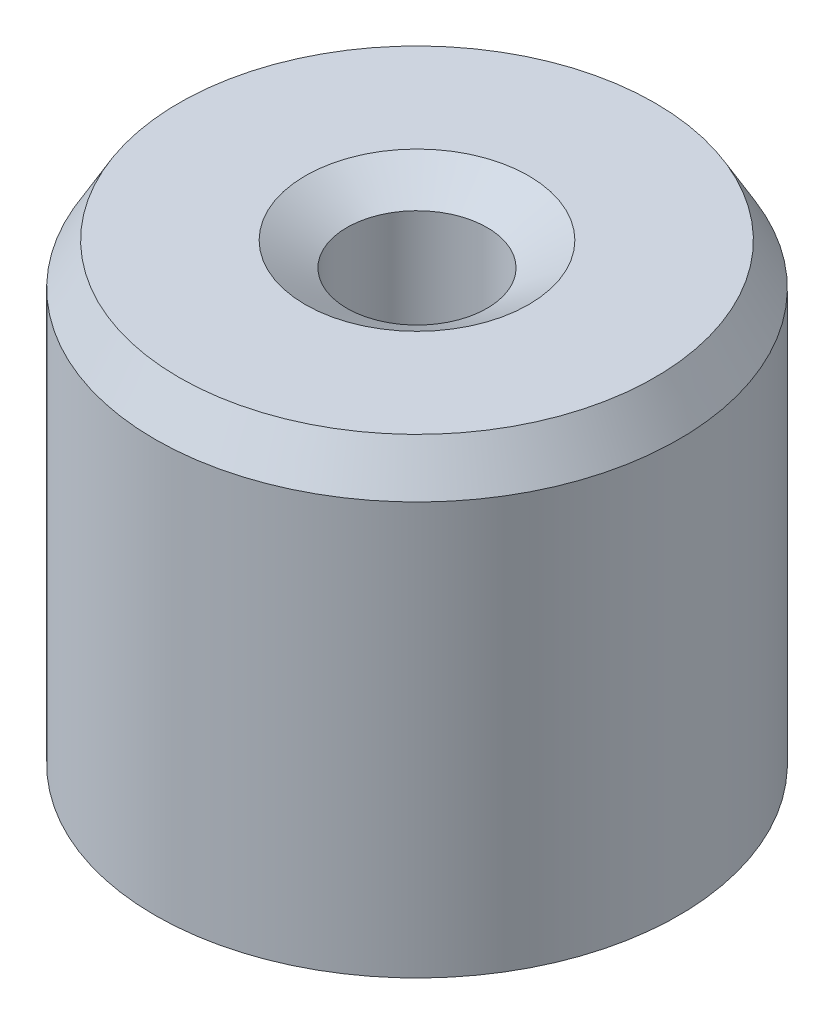
ISO-10303-21;
HEADER;
FILE_DESCRIPTION(('STEP AP214'),'2;1');
FILE_NAME('part.step','',(''),(''),'','','');
FILE_SCHEMA(('AUTOMOTIVE_DESIGN { 1 0 10303 214 1 1 1 1 }'));
ENDSEC;
DATA;
#1=APPLICATION_CONTEXT('core data for automotive mechanical design processes');
#2=APPLICATION_PROTOCOL_DEFINITION('international standard','automotive_design',2000,#1);
#3=PRODUCT_CONTEXT('',#1,'mechanical');
#4=PRODUCT('Part','Part','',(#3));
#5=PRODUCT_RELATED_PRODUCT_CATEGORY('part','',(#4));
#6=PRODUCT_DEFINITION_FORMATION('','',#4);
#7=PRODUCT_DEFINITION_CONTEXT('part definition',#1,'design');
#8=PRODUCT_DEFINITION('design','',#6,#7);
#9=PRODUCT_DEFINITION_SHAPE('','',#8);
#10=(LENGTH_UNIT() NAMED_UNIT(*) SI_UNIT(.MILLI.,.METRE.));
#11=(NAMED_UNIT(*) PLANE_ANGLE_UNIT() SI_UNIT($,.RADIAN.));
#12=(NAMED_UNIT(*) SI_UNIT($,.STERADIAN.) SOLID_ANGLE_UNIT());
#13=UNCERTAINTY_MEASURE_WITH_UNIT(LENGTH_MEASURE(1.E-05),#10,'distance_accuracy_value','');
#14=(GEOMETRIC_REPRESENTATION_CONTEXT(3) GLOBAL_UNCERTAINTY_ASSIGNED_CONTEXT((#13)) GLOBAL_UNIT_ASSIGNED_CONTEXT((#10,
#11,#12)) REPRESENTATION_CONTEXT('',''));
#15=CARTESIAN_POINT('',(0.,0.,0.));
#16=DIRECTION('',(0.,0.,1.));
#17=DIRECTION('',(1.,0.,0.));
#18=AXIS2_PLACEMENT_3D('',#15,#16,#17);
#19=CARTESIAN_POINT('',(0.,9.12309835805716,0.));
#20=DIRECTION('',(0.,-1.,0.));
#21=DIRECTION('',(0.,0.,-1.));
#22=AXIS2_PLACEMENT_3D('',#19,#20,#21);
#23=CYLINDRICAL_SURFACE('',#22,5.);
#24=CARTESIAN_POINT('',(0.,0.458276644913661,0.));
#25=DIRECTION('',(0.,1.,0.));
#26=DIRECTION('',(0.,0.,1.));
#27=AXIS2_PLACEMENT_3D('',#24,#25,#26);
#28=CIRCLE('',#27,5.);
#29=CARTESIAN_POINT('',(0.,0.458276644913661,5.));
#30=VERTEX_POINT('',#29);
#31=EDGE_CURVE('E10',#30,#30,#28,.T.);
#32=ORIENTED_EDGE('',*,*,#31,.T.);
#33=EDGE_LOOP('',(#32));
#34=FACE_BOUND('',#33,.T.);
#35=CARTESIAN_POINT('',(0.,8.3293399251445,0.));
#36=DIRECTION('',(0.,1.,0.));
#37=DIRECTION('',(0.,0.,1.));
#38=AXIS2_PLACEMENT_3D('',#35,#36,#37);
#39=CIRCLE('',#38,5.);
#40=CARTESIAN_POINT('',(0.,8.3293399251445,5.));
#41=VERTEX_POINT('',#40);
#42=EDGE_CURVE('E50',#41,#41,#39,.F.);
#43=ORIENTED_EDGE('',*,*,#42,.T.);
#44=EDGE_LOOP('',(#43));
#45=FACE_BOUND('',#44,.T.);
#46=ADVANCED_FACE('F39',(#34,#45),#23,.T.);
#47=CARTESIAN_POINT('',(0.,9.12309835805716,0.));
#48=DIRECTION('',(0.,1.,0.));
#49=DIRECTION('',(0.,0.,1.));
#50=AXIS2_PLACEMENT_3D('',#47,#48,#49);
#51=PLANE('',#50);
#52=CARTESIAN_POINT('',(0.,9.12309835805716,0.));
#53=DIRECTION('',(0.,1.,0.));
#54=DIRECTION('',(0.,0.,1.));
#55=AXIS2_PLACEMENT_3D('',#52,#53,#54);
#56=CIRCLE('',#55,2.13175419925524);
#57=CARTESIAN_POINT('',(0.,9.12309835805716,2.13175419925524));
#58=VERTEX_POINT('',#57);
#59=EDGE_CURVE('E58',#58,#58,#56,.F.);
#60=ORIENTED_EDGE('',*,*,#59,.T.);
#61=EDGE_LOOP('',(#60));
#62=FACE_BOUND('',#61,.T.);
#63=CARTESIAN_POINT('',(0.,9.12309835805716,0.));
#64=DIRECTION('',(0.,1.,0.));
#65=DIRECTION('',(0.,0.,1.));
#66=AXIS2_PLACEMENT_3D('',#63,#64,#65);
#67=CIRCLE('',#66,4.54172335508634);
#68=CARTESIAN_POINT('',(0.,9.12309835805716,4.54172335508634));
#69=VERTEX_POINT('',#68);
#70=EDGE_CURVE('E61',#69,#69,#67,.T.);
#71=ORIENTED_EDGE('',*,*,#70,.T.);
#72=EDGE_LOOP('',(#71));
#73=FACE_BOUND('',#72,.T.);
#74=ADVANCED_FACE('F88',(#62,#73),#51,.T.);
#75=CARTESIAN_POINT('',(0.,0.,0.));
#76=DIRECTION('',(0.,1.,0.));
#77=DIRECTION('',(0.,0.,1.));
#78=AXIS2_PLACEMENT_3D('',#75,#76,#77);
#79=PLANE('',#78);
#80=CARTESIAN_POINT('',(0.,0.,0.));
#81=DIRECTION('',(0.,1.,0.));
#82=DIRECTION('',(0.,0.,1.));
#83=AXIS2_PLACEMENT_3D('',#80,#81,#82);
#84=CIRCLE('',#83,1.79627241125624);
#85=CARTESIAN_POINT('',(0.,0.,1.79627241125624));
#86=VERTEX_POINT('',#85);
#87=EDGE_CURVE('E51',#86,#86,#84,.T.);
#88=ORIENTED_EDGE('',*,*,#87,.T.);
#89=EDGE_LOOP('',(#88));
#90=FACE_BOUND('',#89,.T.);
#91=CARTESIAN_POINT('',(0.,0.,0.));
#92=DIRECTION('',(0.,1.,0.));
#93=DIRECTION('',(0.,0.,1.));
#94=AXIS2_PLACEMENT_3D('',#91,#92,#93);
#95=CIRCLE('',#94,4.20624156708733);
#96=CARTESIAN_POINT('',(0.,0.,4.20624156708733));
#97=VERTEX_POINT('',#96);
#98=EDGE_CURVE('E54',#97,#97,#95,.F.);
#99=ORIENTED_EDGE('',*,*,#98,.T.);
#100=EDGE_LOOP('',(#99));
#101=FACE_BOUND('',#100,.T.);
#102=ADVANCED_FACE('F83',(#90,#101),#79,.F.);
#103=CARTESIAN_POINT('',(0.,9.12309835805716,0.));
#104=DIRECTION('',(0.,-1.,0.));
#105=DIRECTION('',(0.,0.,-1.));
#106=AXIS2_PLACEMENT_3D('',#103,#104,#105);
#107=CYLINDRICAL_SURFACE('',#106,1.33799576634258);
#108=CARTESIAN_POINT('',(0.,8.66482171314351,0.));
#109=DIRECTION('',(0.,1.,0.));
#110=DIRECTION('',(0.,0.,1.));
#111=AXIS2_PLACEMENT_3D('',#108,#109,#110);
#112=CIRCLE('',#111,1.33799576634258);
#113=CARTESIAN_POINT('',(0.,8.66482171314351,1.33799576634258));
#114=VERTEX_POINT('',#113);
#115=EDGE_CURVE('E67',#114,#114,#112,.T.);
#116=ORIENTED_EDGE('',*,*,#115,.T.);
#117=EDGE_LOOP('',(#116));
#118=FACE_BOUND('',#117,.T.);
#119=CARTESIAN_POINT('',(0.,0.79375843291267,0.));
#120=DIRECTION('',(0.,1.,0.));
#121=DIRECTION('',(0.,0.,1.));
#122=AXIS2_PLACEMENT_3D('',#119,#120,#121);
#123=CIRCLE('',#122,1.33799576634258);
#124=CARTESIAN_POINT('',(0.,0.79375843291267,1.33799576634258));
#125=VERTEX_POINT('',#124);
#126=EDGE_CURVE('E69',#125,#125,#123,.F.);
#127=ORIENTED_EDGE('',*,*,#126,.T.);
#128=EDGE_LOOP('',(#127));
#129=FACE_BOUND('',#128,.T.);
#130=ADVANCED_FACE('F71',(#118,#129),#107,.F.);
#131=CARTESIAN_POINT('',(0.,8.66482171314351,0.));
#132=DIRECTION('',(0.,1.,0.));
#133=DIRECTION('',(0.,0.,1.));
#134=AXIS2_PLACEMENT_3D('',#131,#132,#133);
#135=CONICAL_SURFACE('',#134,1.33799576634258,1.0471975511966);
#136=ORIENTED_EDGE('',*,*,#59,.F.);
#137=EDGE_LOOP('',(#136));
#138=FACE_BOUND('',#137,.T.);
#139=ORIENTED_EDGE('',*,*,#115,.F.);
#140=EDGE_LOOP('',(#139));
#141=FACE_BOUND('',#140,.T.);
#142=ADVANCED_FACE('F77',(#138,#141),#135,.F.);
#143=CARTESIAN_POINT('',(0.,0.,0.));
#144=DIRECTION('',(0.,-1.,0.));
#145=DIRECTION('',(0.,0.,-1.));
#146=AXIS2_PLACEMENT_3D('',#143,#144,#145);
#147=CONICAL_SURFACE('',#146,1.79627241125624,0.523598775598296);
#148=ORIENTED_EDGE('',*,*,#126,.F.);
#149=EDGE_LOOP('',(#148));
#150=FACE_BOUND('',#149,.T.);
#151=ORIENTED_EDGE('',*,*,#87,.F.);
#152=EDGE_LOOP('',(#151));
#153=FACE_BOUND('',#152,.T.);
#154=ADVANCED_FACE('F73',(#150,#153),#147,.F.);
#155=CARTESIAN_POINT('',(0.,0.458276644913661,0.));
#156=DIRECTION('',(0.,1.,0.));
#157=DIRECTION('',(0.,0.,1.));
#158=AXIS2_PLACEMENT_3D('',#155,#156,#157);
#159=CONICAL_SURFACE('',#158,5.,1.0471975511966);
#160=ORIENTED_EDGE('',*,*,#98,.F.);
#161=EDGE_LOOP('',(#160));
#162=FACE_BOUND('',#161,.T.);
#163=ORIENTED_EDGE('',*,*,#31,.F.);
#164=EDGE_LOOP('',(#163));
#165=FACE_BOUND('',#164,.T.);
#166=ADVANCED_FACE('F76',(#162,#165),#159,.T.);
#167=CARTESIAN_POINT('',(0.,9.12309835805716,0.));
#168=DIRECTION('',(0.,-1.,0.));
#169=DIRECTION('',(0.,0.,-1.));
#170=AXIS2_PLACEMENT_3D('',#167,#168,#169);
#171=CONICAL_SURFACE('',#170,4.54172335508634,0.523598775598294);
#172=ORIENTED_EDGE('',*,*,#42,.F.);
#173=EDGE_LOOP('',(#172));
#174=FACE_BOUND('',#173,.T.);
#175=ORIENTED_EDGE('',*,*,#70,.F.);
#176=EDGE_LOOP('',(#175));
#177=FACE_BOUND('',#176,.T.);
#178=ADVANCED_FACE('F45',(#174,#177),#171,.T.);
#179=CLOSED_SHELL('',(#46,#74,#102,#130,#142,#154,#166,#178));
#180=MANIFOLD_SOLID_BREP('B2',#179);
#181=ADVANCED_BREP_SHAPE_REPRESENTATION('',(#18,#180),#14);
#182=SHAPE_DEFINITION_REPRESENTATION(#9,#181);
ENDSEC;
END-ISO-10303-21;
